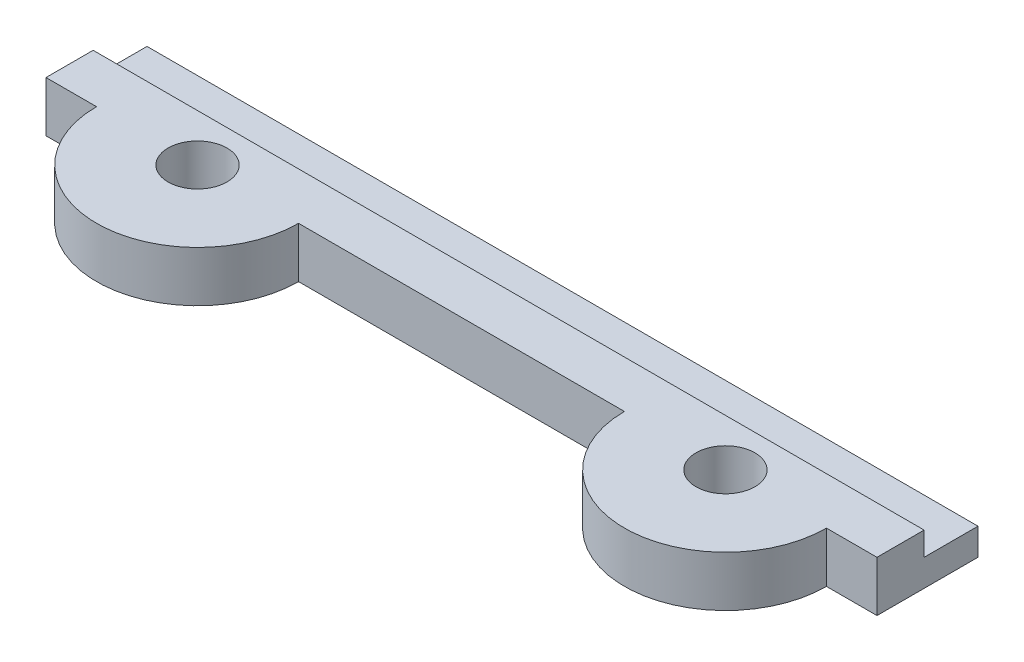
ISO-10303-21;
HEADER;
FILE_DESCRIPTION(('STEP AP214'),'2;1');
FILE_NAME('part.step','',(''),(''),'','','');
FILE_SCHEMA(('AUTOMOTIVE_DESIGN { 1 0 10303 214 1 1 1 1 }'));
ENDSEC;
DATA;
#1=APPLICATION_CONTEXT('core data for automotive mechanical design processes');
#2=APPLICATION_PROTOCOL_DEFINITION('international standard','automotive_design',2000,#1);
#3=PRODUCT_CONTEXT('',#1,'mechanical');
#4=PRODUCT('Part','Part','',(#3));
#5=PRODUCT_RELATED_PRODUCT_CATEGORY('part','',(#4));
#6=PRODUCT_DEFINITION_FORMATION('','',#4);
#7=PRODUCT_DEFINITION_CONTEXT('part definition',#1,'design');
#8=PRODUCT_DEFINITION('design','',#6,#7);
#9=PRODUCT_DEFINITION_SHAPE('','',#8);
#10=(LENGTH_UNIT() NAMED_UNIT(*) SI_UNIT(.MILLI.,.METRE.));
#11=(NAMED_UNIT(*) PLANE_ANGLE_UNIT() SI_UNIT($,.RADIAN.));
#12=(NAMED_UNIT(*) SI_UNIT($,.STERADIAN.) SOLID_ANGLE_UNIT());
#13=UNCERTAINTY_MEASURE_WITH_UNIT(LENGTH_MEASURE(1.E-05),#10,'distance_accuracy_value','');
#14=(GEOMETRIC_REPRESENTATION_CONTEXT(3) GLOBAL_UNCERTAINTY_ASSIGNED_CONTEXT((#13)) GLOBAL_UNIT_ASSIGNED_CONTEXT((#10,
#11,#12)) REPRESENTATION_CONTEXT('',''));
#15=CARTESIAN_POINT('',(0.,0.,0.));
#16=DIRECTION('',(0.,0.,1.));
#17=DIRECTION('',(1.,0.,0.));
#18=AXIS2_PLACEMENT_3D('',#15,#16,#17);
#19=CARTESIAN_POINT('',(-24.4597731026111,3.,-5.51793108238525));
#20=DIRECTION('',(0.,0.,1.));
#21=DIRECTION('',(1.,0.,0.));
#22=AXIS2_PLACEMENT_3D('',#19,#20,#21);
#23=PLANE('',#22);
#24=DIRECTION('',(-1.,0.,0.));
#25=VECTOR('',#24,1.);
#26=CARTESIAN_POINT('',(-24.4597731026111,1.6,-5.51793108238525));
#27=LINE('',#26,#25);
#28=CARTESIAN_POINT('',(24.8959984575922,1.6,-5.51793108238525));
#29=VERTEX_POINT('',#28);
#30=CARTESIAN_POINT('',(-24.4597731026111,1.6,-5.51793108238525));
#31=VERTEX_POINT('',#30);
#32=EDGE_CURVE('E50',#29,#31,#27,.T.);
#33=ORIENTED_EDGE('',*,*,#32,.F.);
#34=DIRECTION('',(0.,-1.,0.));
#35=VECTOR('',#34,1.);
#36=CARTESIAN_POINT('',(24.8959984575922,3.,-5.51793108238525));
#37=LINE('',#36,#35);
#38=CARTESIAN_POINT('',(24.8959984575922,0.,-5.51793108238525));
#39=VERTEX_POINT('',#38);
#40=EDGE_CURVE('E164',#29,#39,#37,.T.);
#41=ORIENTED_EDGE('',*,*,#40,.T.);
#42=DIRECTION('',(-1.,0.,0.));
#43=VECTOR('',#42,1.);
#44=CARTESIAN_POINT('',(-24.4597731026111,0.,-5.51793108238525));
#45=LINE('',#44,#43);
#46=CARTESIAN_POINT('',(-24.4597731026111,0.,-5.51793108238525));
#47=VERTEX_POINT('',#46);
#48=EDGE_CURVE('E149',#39,#47,#45,.T.);
#49=ORIENTED_EDGE('',*,*,#48,.T.);
#50=DIRECTION('',(0.,-1.,0.));
#51=VECTOR('',#50,1.);
#52=CARTESIAN_POINT('',(-24.4597731026111,3.,-5.51793108238525));
#53=LINE('',#52,#51);
#54=EDGE_CURVE('E162',#31,#47,#53,.T.);
#55=ORIENTED_EDGE('',*,*,#54,.F.);
#56=EDGE_LOOP('',(#33,#41,#49,#55));
#57=FACE_BOUND('',#56,.T.);
#58=ADVANCED_FACE('F35',(#57),#23,.F.);
#59=CARTESIAN_POINT('',(15.8959984575922,3.,0.48206891761475));
#60=DIRECTION('',(0.,1.,0.));
#61=DIRECTION('',(0.,0.,1.));
#62=AXIS2_PLACEMENT_3D('',#59,#60,#61);
#63=PLANE('',#62);
#64=DIRECTION('',(1.,0.,0.));
#65=VECTOR('',#64,1.);
#66=CARTESIAN_POINT('',(-24.4597731026111,3.,-2.31793108238525));
#67=LINE('',#66,#65);
#68=CARTESIAN_POINT('',(-24.4597731026111,3.,-2.31793108238525));
#69=VERTEX_POINT('',#68);
#70=CARTESIAN_POINT('',(24.8959984575922,3.,-2.31793108238525));
#71=VERTEX_POINT('',#70);
#72=EDGE_CURVE('E198',#69,#71,#67,.T.);
#73=ORIENTED_EDGE('',*,*,#72,.F.);
#74=DIRECTION('',(0.,0.,1.));
#75=VECTOR('',#74,1.);
#76=CARTESIAN_POINT('',(-24.4597731026111,3.,0.482068917614751));
#77=LINE('',#76,#75);
#78=CARTESIAN_POINT('',(-24.4597731026111,3.,0.482068917614751));
#79=VERTEX_POINT('',#78);
#80=EDGE_CURVE('E119',#69,#79,#77,.T.);
#81=ORIENTED_EDGE('',*,*,#80,.T.);
#82=DIRECTION('',(1.,0.,0.));
#83=VECTOR('',#82,1.);
#84=CARTESIAN_POINT('',(-21.4597731026111,3.,0.48206891761475));
#85=LINE('',#84,#83);
#86=CARTESIAN_POINT('',(-21.4597731026111,3.,0.482068917614749));
#87=VERTEX_POINT('',#86);
#88=EDGE_CURVE('E110',#79,#87,#85,.T.);
#89=ORIENTED_EDGE('',*,*,#88,.T.);
#90=CARTESIAN_POINT('',(-15.4597731026111,3.,0.48206891761475));
#91=DIRECTION('',(0.,1.,0.));
#92=DIRECTION('',(0.,0.,1.));
#93=AXIS2_PLACEMENT_3D('',#90,#91,#92);
#94=CIRCLE('',#93,6.);
#95=CARTESIAN_POINT('',(-9.45977310261113,3.,0.48206891761475));
#96=VERTEX_POINT('',#95);
#97=EDGE_CURVE('E116',#87,#96,#94,.T.);
#98=ORIENTED_EDGE('',*,*,#97,.T.);
#99=DIRECTION('',(1.,0.,0.));
#100=VECTOR('',#99,1.);
#101=CARTESIAN_POINT('',(9.89599845759223,3.,0.48206891761475));
#102=LINE('',#101,#100);
#103=CARTESIAN_POINT('',(9.89599845759223,3.,0.48206891761475));
#104=VERTEX_POINT('',#103);
#105=EDGE_CURVE('E59',#96,#104,#102,.T.);
#106=ORIENTED_EDGE('',*,*,#105,.T.);
#107=CARTESIAN_POINT('',(15.8959984575922,3.,0.48206891761475));
#108=DIRECTION('',(0.,1.,0.));
#109=DIRECTION('',(0.,0.,1.));
#110=AXIS2_PLACEMENT_3D('',#107,#108,#109);
#111=CIRCLE('',#110,6.);
#112=CARTESIAN_POINT('',(21.8959984575922,3.,0.48206891761475));
#113=VERTEX_POINT('',#112);
#114=EDGE_CURVE('E158',#104,#113,#111,.T.);
#115=ORIENTED_EDGE('',*,*,#114,.T.);
#116=DIRECTION('',(1.,0.,0.));
#117=VECTOR('',#116,1.);
#118=CARTESIAN_POINT('',(21.8959984575922,3.,0.48206891761475));
#119=LINE('',#118,#117);
#120=CARTESIAN_POINT('',(24.8959984575922,3.,0.482068917614745));
#121=VERTEX_POINT('',#120);
#122=EDGE_CURVE('E100',#113,#121,#119,.T.);
#123=ORIENTED_EDGE('',*,*,#122,.T.);
#124=DIRECTION('',(0.,0.,-1.));
#125=VECTOR('',#124,1.);
#126=CARTESIAN_POINT('',(24.8959984575922,3.,0.482068917614745));
#127=LINE('',#126,#125);
#128=EDGE_CURVE('E175',#121,#71,#127,.T.);
#129=ORIENTED_EDGE('',*,*,#128,.T.);
#130=EDGE_LOOP('',(#73,#81,#89,#98,#106,#115,#123,#129));
#131=FACE_BOUND('',#130,.T.);
#132=CARTESIAN_POINT('',(15.8959984575922,3.,0.48206891761475));
#133=DIRECTION('',(0.,1.,0.));
#134=DIRECTION('',(0.,0.,1.));
#135=AXIS2_PLACEMENT_3D('',#132,#133,#134);
#136=CIRCLE('',#135,1.75);
#137=CARTESIAN_POINT('',(15.8959984575922,3.,2.23206891761475));
#138=VERTEX_POINT('',#137);
#139=EDGE_CURVE('E144',#138,#138,#136,.T.);
#140=ORIENTED_EDGE('',*,*,#139,.F.);
#141=EDGE_LOOP('',(#140));
#142=FACE_BOUND('',#141,.T.);
#143=CARTESIAN_POINT('',(-15.4597731026111,3.,0.48206891761475));
#144=DIRECTION('',(0.,1.,0.));
#145=DIRECTION('',(0.,0.,1.));
#146=AXIS2_PLACEMENT_3D('',#143,#144,#145);
#147=CIRCLE('',#146,1.75);
#148=CARTESIAN_POINT('',(-15.4597731026111,3.,2.23206891761475));
#149=VERTEX_POINT('',#148);
#150=EDGE_CURVE('E214',#149,#149,#147,.T.);
#151=ORIENTED_EDGE('',*,*,#150,.F.);
#152=EDGE_LOOP('',(#151));
#153=FACE_BOUND('',#152,.T.);
#154=ADVANCED_FACE('F113',(#131,#142,#153),#63,.T.);
#155=CARTESIAN_POINT('',(15.8959984575922,0.,0.48206891761475));
#156=DIRECTION('',(0.,1.,0.));
#157=DIRECTION('',(0.,0.,1.));
#158=AXIS2_PLACEMENT_3D('',#155,#156,#157);
#159=PLANE('',#158);
#160=CARTESIAN_POINT('',(15.8959984575922,0.,0.48206891761475));
#161=DIRECTION('',(0.,1.,0.));
#162=DIRECTION('',(0.,0.,1.));
#163=AXIS2_PLACEMENT_3D('',#160,#161,#162);
#164=CIRCLE('',#163,6.);
#165=CARTESIAN_POINT('',(9.89599845759223,0.,0.48206891761475));
#166=VERTEX_POINT('',#165);
#167=CARTESIAN_POINT('',(21.8959984575922,0.,0.48206891761475));
#168=VERTEX_POINT('',#167);
#169=EDGE_CURVE('E140',#166,#168,#164,.T.);
#170=ORIENTED_EDGE('',*,*,#169,.F.);
#171=DIRECTION('',(1.,0.,0.));
#172=VECTOR('',#171,1.);
#173=CARTESIAN_POINT('',(9.89599845759223,0.,0.48206891761475));
#174=LINE('',#173,#172);
#175=CARTESIAN_POINT('',(-9.45977310261113,0.,0.48206891761475));
#176=VERTEX_POINT('',#175);
#177=EDGE_CURVE('E92',#176,#166,#174,.T.);
#178=ORIENTED_EDGE('',*,*,#177,.F.);
#179=CARTESIAN_POINT('',(-15.4597731026111,0.,0.48206891761475));
#180=DIRECTION('',(0.,1.,0.));
#181=DIRECTION('',(0.,0.,1.));
#182=AXIS2_PLACEMENT_3D('',#179,#180,#181);
#183=CIRCLE('',#182,6.);
#184=CARTESIAN_POINT('',(-21.4597731026111,0.,0.482068917614749));
#185=VERTEX_POINT('',#184);
#186=EDGE_CURVE('E155',#185,#176,#183,.T.);
#187=ORIENTED_EDGE('',*,*,#186,.F.);
#188=DIRECTION('',(1.,0.,0.));
#189=VECTOR('',#188,1.);
#190=CARTESIAN_POINT('',(-21.4597731026111,0.,0.48206891761475));
#191=LINE('',#190,#189);
#192=CARTESIAN_POINT('',(-24.4597731026111,0.,0.482068917614751));
#193=VERTEX_POINT('',#192);
#194=EDGE_CURVE('E128',#193,#185,#191,.T.);
#195=ORIENTED_EDGE('',*,*,#194,.F.);
#196=DIRECTION('',(0.,0.,1.));
#197=VECTOR('',#196,1.);
#198=CARTESIAN_POINT('',(-24.4597731026111,0.,0.482068917614751));
#199=LINE('',#198,#197);
#200=EDGE_CURVE('E152',#47,#193,#199,.T.);
#201=ORIENTED_EDGE('',*,*,#200,.F.);
#202=ORIENTED_EDGE('',*,*,#48,.F.);
#203=DIRECTION('',(0.,0.,-1.));
#204=VECTOR('',#203,1.);
#205=CARTESIAN_POINT('',(24.8959984575922,0.,0.482068917614745));
#206=LINE('',#205,#204);
#207=CARTESIAN_POINT('',(24.8959984575922,0.,0.482068917614745));
#208=VERTEX_POINT('',#207);
#209=EDGE_CURVE('E146',#208,#39,#206,.T.);
#210=ORIENTED_EDGE('',*,*,#209,.F.);
#211=DIRECTION('',(1.,0.,0.));
#212=VECTOR('',#211,1.);
#213=CARTESIAN_POINT('',(21.8959984575922,0.,0.48206891761475));
#214=LINE('',#213,#212);
#215=EDGE_CURVE('E143',#168,#208,#214,.T.);
#216=ORIENTED_EDGE('',*,*,#215,.F.);
#217=EDGE_LOOP('',(#170,#178,#187,#195,#201,#202,#210,#216));
#218=FACE_BOUND('',#217,.T.);
#219=CARTESIAN_POINT('',(15.8959984575922,0.,0.48206891761475));
#220=DIRECTION('',(0.,1.,0.));
#221=DIRECTION('',(0.,0.,1.));
#222=AXIS2_PLACEMENT_3D('',#219,#220,#221);
#223=CIRCLE('',#222,1.75);
#224=CARTESIAN_POINT('',(15.8959984575922,0.,2.23206891761475));
#225=VERTEX_POINT('',#224);
#226=EDGE_CURVE('E217',#225,#225,#223,.T.);
#227=ORIENTED_EDGE('',*,*,#226,.T.);
#228=EDGE_LOOP('',(#227));
#229=FACE_BOUND('',#228,.T.);
#230=CARTESIAN_POINT('',(-15.4597731026111,0.,0.48206891761475));
#231=DIRECTION('',(0.,1.,0.));
#232=DIRECTION('',(0.,0.,1.));
#233=AXIS2_PLACEMENT_3D('',#230,#231,#232);
#234=CIRCLE('',#233,1.75);
#235=CARTESIAN_POINT('',(-15.4597731026111,0.,2.23206891761475));
#236=VERTEX_POINT('',#235);
#237=EDGE_CURVE('E209',#236,#236,#234,.T.);
#238=ORIENTED_EDGE('',*,*,#237,.T.);
#239=EDGE_LOOP('',(#238));
#240=FACE_BOUND('',#239,.T.);
#241=ADVANCED_FACE('F178',(#218,#229,#240),#159,.F.);
#242=CARTESIAN_POINT('',(15.8959984575922,3.,0.48206891761475));
#243=DIRECTION('',(0.,-1.,0.));
#244=DIRECTION('',(0.,0.,-1.));
#245=AXIS2_PLACEMENT_3D('',#242,#243,#244);
#246=CYLINDRICAL_SURFACE('',#245,6.);
#247=ORIENTED_EDGE('',*,*,#169,.T.);
#248=DIRECTION('',(0.,-1.,0.));
#249=VECTOR('',#248,1.);
#250=CARTESIAN_POINT('',(21.8959984575922,3.,0.48206891761475));
#251=LINE('',#250,#249);
#252=EDGE_CURVE('E11',#113,#168,#251,.T.);
#253=ORIENTED_EDGE('',*,*,#252,.F.);
#254=ORIENTED_EDGE('',*,*,#114,.F.);
#255=DIRECTION('',(0.,-1.,0.));
#256=VECTOR('',#255,1.);
#257=CARTESIAN_POINT('',(9.89599845759223,3.,0.48206891761475));
#258=LINE('',#257,#256);
#259=EDGE_CURVE('E136',#104,#166,#258,.T.);
#260=ORIENTED_EDGE('',*,*,#259,.T.);
#261=EDGE_LOOP('',(#247,#253,#254,#260));
#262=FACE_BOUND('',#261,.T.);
#263=ADVANCED_FACE('F37',(#262),#246,.T.);
#264=CARTESIAN_POINT('',(21.8959984575922,3.,0.48206891761475));
#265=DIRECTION('',(0.,0.,-1.));
#266=DIRECTION('',(-1.,0.,0.));
#267=AXIS2_PLACEMENT_3D('',#264,#265,#266);
#268=PLANE('',#267);
#269=ORIENTED_EDGE('',*,*,#215,.T.);
#270=DIRECTION('',(0.,-1.,0.));
#271=VECTOR('',#270,1.);
#272=CARTESIAN_POINT('',(24.8959984575922,3.,0.482068917614745));
#273=LINE('',#272,#271);
#274=EDGE_CURVE('E43',#121,#208,#273,.T.);
#275=ORIENTED_EDGE('',*,*,#274,.F.);
#276=ORIENTED_EDGE('',*,*,#122,.F.);
#277=ORIENTED_EDGE('',*,*,#252,.T.);
#278=EDGE_LOOP('',(#269,#275,#276,#277));
#279=FACE_BOUND('',#278,.T.);
#280=ADVANCED_FACE('F229',(#279),#268,.F.);
#281=CARTESIAN_POINT('',(24.8959984575922,3.,0.482068917614745));
#282=DIRECTION('',(-1.,0.,0.));
#283=DIRECTION('',(0.,0.,1.));
#284=AXIS2_PLACEMENT_3D('',#281,#282,#283);
#285=PLANE('',#284);
#286=DIRECTION('',(0.,0.,-1.));
#287=VECTOR('',#286,1.);
#288=CARTESIAN_POINT('',(24.8959984575922,1.6,-5.51793108238525));
#289=LINE('',#288,#287);
#290=CARTESIAN_POINT('',(24.8959984575922,1.6,-2.31793108238525));
#291=VERTEX_POINT('',#290);
#292=EDGE_CURVE('E184',#291,#29,#289,.T.);
#293=ORIENTED_EDGE('',*,*,#292,.F.);
#294=DIRECTION('',(0.,1.,0.));
#295=VECTOR('',#294,1.);
#296=CARTESIAN_POINT('',(24.8959984575922,1.6,-2.31793108238525));
#297=LINE('',#296,#295);
#298=EDGE_CURVE('E201',#291,#71,#297,.T.);
#299=ORIENTED_EDGE('',*,*,#298,.T.);
#300=ORIENTED_EDGE('',*,*,#128,.F.);
#301=ORIENTED_EDGE('',*,*,#274,.T.);
#302=ORIENTED_EDGE('',*,*,#209,.T.);
#303=ORIENTED_EDGE('',*,*,#40,.F.);
#304=EDGE_LOOP('',(#293,#299,#300,#301,#302,#303));
#305=FACE_BOUND('',#304,.T.);
#306=ADVANCED_FACE('F170',(#305),#285,.F.);
#307=CARTESIAN_POINT('',(-24.4597731026111,3.,0.482068917614751));
#308=DIRECTION('',(1.,0.,0.));
#309=DIRECTION('',(0.,0.,-1.));
#310=AXIS2_PLACEMENT_3D('',#307,#308,#309);
#311=PLANE('',#310);
#312=ORIENTED_EDGE('',*,*,#80,.F.);
#313=DIRECTION('',(0.,1.,0.));
#314=VECTOR('',#313,1.);
#315=CARTESIAN_POINT('',(-24.4597731026111,1.6,-2.31793108238525));
#316=LINE('',#315,#314);
#317=CARTESIAN_POINT('',(-24.4597731026111,1.6,-2.31793108238525));
#318=VERTEX_POINT('',#317);
#319=EDGE_CURVE('E197',#318,#69,#316,.T.);
#320=ORIENTED_EDGE('',*,*,#319,.F.);
#321=DIRECTION('',(0.,0.,1.));
#322=VECTOR('',#321,1.);
#323=CARTESIAN_POINT('',(-24.4597731026111,1.6,-5.51793108238525));
#324=LINE('',#323,#322);
#325=EDGE_CURVE('E202',#31,#318,#324,.T.);
#326=ORIENTED_EDGE('',*,*,#325,.F.);
#327=ORIENTED_EDGE('',*,*,#54,.T.);
#328=ORIENTED_EDGE('',*,*,#200,.T.);
#329=DIRECTION('',(0.,-1.,0.));
#330=VECTOR('',#329,1.);
#331=CARTESIAN_POINT('',(-24.4597731026111,3.,0.482068917614751));
#332=LINE('',#331,#330);
#333=EDGE_CURVE('E131',#79,#193,#332,.T.);
#334=ORIENTED_EDGE('',*,*,#333,.F.);
#335=EDGE_LOOP('',(#312,#320,#326,#327,#328,#334));
#336=FACE_BOUND('',#335,.T.);
#337=ADVANCED_FACE('F207',(#336),#311,.F.);
#338=CARTESIAN_POINT('',(-21.4597731026111,3.,0.48206891761475));
#339=DIRECTION('',(0.,0.,-1.));
#340=DIRECTION('',(-1.,0.,0.));
#341=AXIS2_PLACEMENT_3D('',#338,#339,#340);
#342=PLANE('',#341);
#343=ORIENTED_EDGE('',*,*,#194,.T.);
#344=DIRECTION('',(0.,-1.,0.));
#345=VECTOR('',#344,1.);
#346=CARTESIAN_POINT('',(-21.4597731026111,3.,0.482068917614749));
#347=LINE('',#346,#345);
#348=EDGE_CURVE('E125',#87,#185,#347,.T.);
#349=ORIENTED_EDGE('',*,*,#348,.F.);
#350=ORIENTED_EDGE('',*,*,#88,.F.);
#351=ORIENTED_EDGE('',*,*,#333,.T.);
#352=EDGE_LOOP('',(#343,#349,#350,#351));
#353=FACE_BOUND('',#352,.T.);
#354=ADVANCED_FACE('F126',(#353),#342,.F.);
#355=CARTESIAN_POINT('',(-15.4597731026111,3.,0.48206891761475));
#356=DIRECTION('',(0.,-1.,0.));
#357=DIRECTION('',(0.,0.,-1.));
#358=AXIS2_PLACEMENT_3D('',#355,#356,#357);
#359=CYLINDRICAL_SURFACE('',#358,6.);
#360=ORIENTED_EDGE('',*,*,#186,.T.);
#361=DIRECTION('',(0.,-1.,0.));
#362=VECTOR('',#361,1.);
#363=CARTESIAN_POINT('',(-9.45977310261113,3.,0.48206891761475));
#364=LINE('',#363,#362);
#365=EDGE_CURVE('E132',#96,#176,#364,.T.);
#366=ORIENTED_EDGE('',*,*,#365,.F.);
#367=ORIENTED_EDGE('',*,*,#97,.F.);
#368=ORIENTED_EDGE('',*,*,#348,.T.);
#369=EDGE_LOOP('',(#360,#366,#367,#368));
#370=FACE_BOUND('',#369,.T.);
#371=ADVANCED_FACE('F134',(#370),#359,.T.);
#372=CARTESIAN_POINT('',(9.89599845759223,3.,0.48206891761475));
#373=DIRECTION('',(0.,0.,-1.));
#374=DIRECTION('',(-1.,0.,0.));
#375=AXIS2_PLACEMENT_3D('',#372,#373,#374);
#376=PLANE('',#375);
#377=ORIENTED_EDGE('',*,*,#177,.T.);
#378=ORIENTED_EDGE('',*,*,#259,.F.);
#379=ORIENTED_EDGE('',*,*,#105,.F.);
#380=ORIENTED_EDGE('',*,*,#365,.T.);
#381=EDGE_LOOP('',(#377,#378,#379,#380));
#382=FACE_BOUND('',#381,.T.);
#383=ADVANCED_FACE('F249',(#382),#376,.F.);
#384=CARTESIAN_POINT('',(15.8959984575922,3.,0.48206891761475));
#385=DIRECTION('',(0.,-1.,0.));
#386=DIRECTION('',(0.,0.,-1.));
#387=AXIS2_PLACEMENT_3D('',#384,#385,#386);
#388=CYLINDRICAL_SURFACE('',#387,1.75);
#389=ORIENTED_EDGE('',*,*,#139,.T.);
#390=EDGE_LOOP('',(#389));
#391=FACE_BOUND('',#390,.T.);
#392=ORIENTED_EDGE('',*,*,#226,.F.);
#393=EDGE_LOOP('',(#392));
#394=FACE_BOUND('',#393,.T.);
#395=ADVANCED_FACE('F252',(#391,#394),#388,.F.);
#396=CARTESIAN_POINT('',(-15.4597731026111,3.,0.48206891761475));
#397=DIRECTION('',(0.,-1.,0.));
#398=DIRECTION('',(0.,0.,-1.));
#399=AXIS2_PLACEMENT_3D('',#396,#397,#398);
#400=CYLINDRICAL_SURFACE('',#399,1.75);
#401=ORIENTED_EDGE('',*,*,#150,.T.);
#402=EDGE_LOOP('',(#401));
#403=FACE_BOUND('',#402,.T.);
#404=ORIENTED_EDGE('',*,*,#237,.F.);
#405=EDGE_LOOP('',(#404));
#406=FACE_BOUND('',#405,.T.);
#407=ADVANCED_FACE('F257',(#403,#406),#400,.F.);
#408=CARTESIAN_POINT('',(-24.4597731026111,1.6,-2.31793108238525));
#409=DIRECTION('',(0.,0.,1.));
#410=DIRECTION('',(1.,0.,0.));
#411=AXIS2_PLACEMENT_3D('',#408,#409,#410);
#412=PLANE('',#411);
#413=ORIENTED_EDGE('',*,*,#72,.T.);
#414=ORIENTED_EDGE('',*,*,#298,.F.);
#415=DIRECTION('',(1.,0.,0.));
#416=VECTOR('',#415,1.);
#417=CARTESIAN_POINT('',(-24.4597731026111,1.6,-2.31793108238525));
#418=LINE('',#417,#416);
#419=EDGE_CURVE('E199',#318,#291,#418,.T.);
#420=ORIENTED_EDGE('',*,*,#419,.F.);
#421=ORIENTED_EDGE('',*,*,#319,.T.);
#422=EDGE_LOOP('',(#413,#414,#420,#421));
#423=FACE_BOUND('',#422,.T.);
#424=ADVANCED_FACE('F200',(#423),#412,.F.);
#425=CARTESIAN_POINT('',(0.,1.6,0.));
#426=DIRECTION('',(0.,1.,0.));
#427=DIRECTION('',(0.,0.,1.));
#428=AXIS2_PLACEMENT_3D('',#425,#426,#427);
#429=PLANE('',#428);
#430=ORIENTED_EDGE('',*,*,#325,.T.);
#431=ORIENTED_EDGE('',*,*,#419,.T.);
#432=ORIENTED_EDGE('',*,*,#292,.T.);
#433=ORIENTED_EDGE('',*,*,#32,.T.);
#434=EDGE_LOOP('',(#430,#431,#432,#433));
#435=FACE_BOUND('',#434,.T.);
#436=ADVANCED_FACE('F204',(#435),#429,.T.);
#437=CLOSED_SHELL('',(#58,#154,#241,#263,#280,#306,#337,#354,#371,#383,#395,#407,#424,#436));
#438=MANIFOLD_SOLID_BREP('B2',#437);
#439=ADVANCED_BREP_SHAPE_REPRESENTATION('',(#18,#438),#14);
#440=SHAPE_DEFINITION_REPRESENTATION(#9,#439);
ENDSEC;
END-ISO-10303-21;
